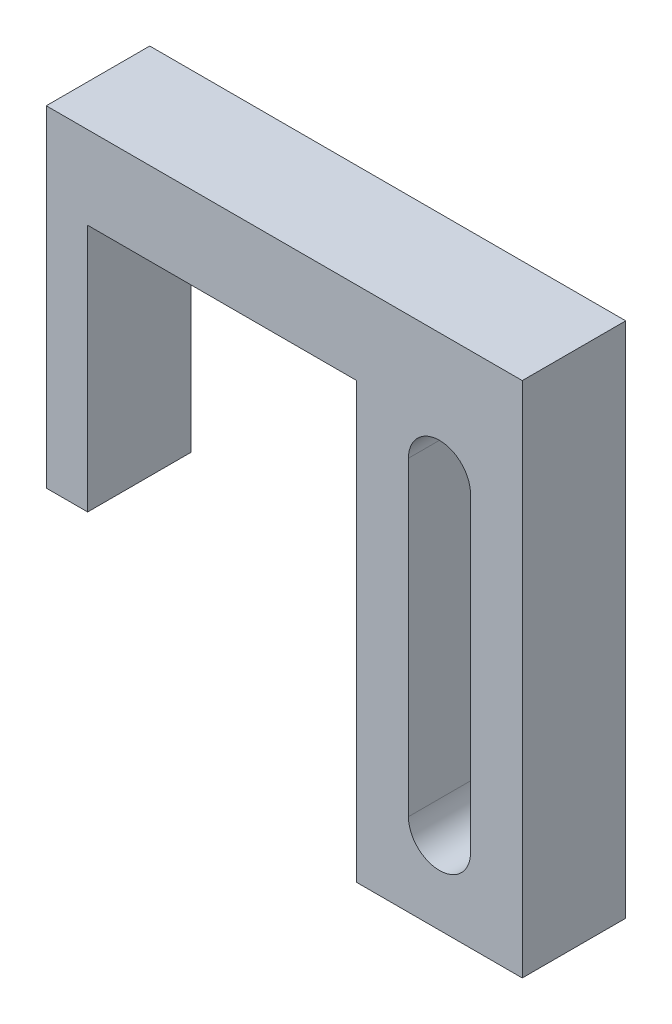
ISO-10303-21;
HEADER;
FILE_DESCRIPTION(('STEP AP214'),'2;1');
FILE_NAME('part.step','',(''),(''),'','','');
FILE_SCHEMA(('AUTOMOTIVE_DESIGN { 1 0 10303 214 1 1 1 1 }'));
ENDSEC;
DATA;
#1=APPLICATION_CONTEXT('core data for automotive mechanical design processes');
#2=APPLICATION_PROTOCOL_DEFINITION('international standard','automotive_design',2000,#1);
#3=PRODUCT_CONTEXT('',#1,'mechanical');
#4=PRODUCT('Part','Part','',(#3));
#5=PRODUCT_RELATED_PRODUCT_CATEGORY('part','',(#4));
#6=PRODUCT_DEFINITION_FORMATION('','',#4);
#7=PRODUCT_DEFINITION_CONTEXT('part definition',#1,'design');
#8=PRODUCT_DEFINITION('design','',#6,#7);
#9=PRODUCT_DEFINITION_SHAPE('','',#8);
#10=(LENGTH_UNIT() NAMED_UNIT(*) SI_UNIT(.MILLI.,.METRE.));
#11=(NAMED_UNIT(*) PLANE_ANGLE_UNIT() SI_UNIT($,.RADIAN.));
#12=(NAMED_UNIT(*) SI_UNIT($,.STERADIAN.) SOLID_ANGLE_UNIT());
#13=UNCERTAINTY_MEASURE_WITH_UNIT(LENGTH_MEASURE(1.E-05),#10,'distance_accuracy_value','');
#14=(GEOMETRIC_REPRESENTATION_CONTEXT(3) GLOBAL_UNCERTAINTY_ASSIGNED_CONTEXT((#13)) GLOBAL_UNIT_ASSIGNED_CONTEXT((#10,
#11,#12)) REPRESENTATION_CONTEXT('',''));
#15=CARTESIAN_POINT('',(0.,0.,0.));
#16=DIRECTION('',(0.,0.,1.));
#17=DIRECTION('',(1.,0.,0.));
#18=AXIS2_PLACEMENT_3D('',#15,#16,#17);
#19=CARTESIAN_POINT('',(-4.,8.5,-18.02417469626));
#20=DIRECTION('',(0.,-1.,0.));
#21=DIRECTION('',(1.,0.,0.));
#22=AXIS2_PLACEMENT_3D('',#19,#20,#21);
#23=PLANE('',#22);
#24=DIRECTION('',(1.,0.,0.));
#25=VECTOR('',#24,1.);
#26=CARTESIAN_POINT('',(-4.,8.5,2.5));
#27=LINE('',#26,#25);
#28=CARTESIAN_POINT('',(-17.,8.5,2.5));
#29=VERTEX_POINT('',#28);
#30=CARTESIAN_POINT('',(-4.,8.5,2.5));
#31=VERTEX_POINT('',#30);
#32=EDGE_CURVE('E189',#29,#31,#27,.T.);
#33=ORIENTED_EDGE('',*,*,#32,.F.);
#34=DIRECTION('',(0.,0.,1.));
#35=VECTOR('',#34,1.);
#36=CARTESIAN_POINT('',(-17.,8.5,2.5));
#37=LINE('',#36,#35);
#38=CARTESIAN_POINT('',(-17.,8.5,-2.5));
#39=VERTEX_POINT('',#38);
#40=EDGE_CURVE('E159',#39,#29,#37,.T.);
#41=ORIENTED_EDGE('',*,*,#40,.F.);
#42=DIRECTION('',(-1.,0.,0.));
#43=VECTOR('',#42,1.);
#44=CARTESIAN_POINT('',(-4.,8.5,-2.5));
#45=LINE('',#44,#43);
#46=CARTESIAN_POINT('',(-4.,8.49999999999999,-2.5));
#47=VERTEX_POINT('',#46);
#48=EDGE_CURVE('E183',#47,#39,#45,.T.);
#49=ORIENTED_EDGE('',*,*,#48,.F.);
#50=DIRECTION('',(0.,0.,1.));
#51=VECTOR('',#50,1.);
#52=CARTESIAN_POINT('',(-4.,8.5,-18.02417469626));
#53=LINE('',#52,#51);
#54=EDGE_CURVE('E184',#47,#31,#53,.T.);
#55=ORIENTED_EDGE('',*,*,#54,.T.);
#56=EDGE_LOOP('',(#33,#41,#49,#55));
#57=FACE_BOUND('',#56,.T.);
#58=ADVANCED_FACE('F37',(#57),#23,.T.);
#59=CARTESIAN_POINT('',(4.,-12.5,2.5));
#60=DIRECTION('',(-1.,0.,0.));
#61=DIRECTION('',(0.,0.,1.));
#62=AXIS2_PLACEMENT_3D('',#59,#60,#61);
#63=PLANE('',#62);
#64=DIRECTION('',(0.,1.,0.));
#65=VECTOR('',#64,1.);
#66=CARTESIAN_POINT('',(4.,-12.5,-2.5));
#67=LINE('',#66,#65);
#68=CARTESIAN_POINT('',(4.,-12.5,-2.5));
#69=VERTEX_POINT('',#68);
#70=CARTESIAN_POINT('',(4.,12.5,-2.5));
#71=VERTEX_POINT('',#70);
#72=EDGE_CURVE('E187',#69,#71,#67,.T.);
#73=ORIENTED_EDGE('',*,*,#72,.T.);
#74=DIRECTION('',(0.,0.,-1.));
#75=VECTOR('',#74,1.);
#76=CARTESIAN_POINT('',(4.,12.5,2.5));
#77=LINE('',#76,#75);
#78=CARTESIAN_POINT('',(4.,12.5,2.5));
#79=VERTEX_POINT('',#78);
#80=EDGE_CURVE('E11',#79,#71,#77,.T.);
#81=ORIENTED_EDGE('',*,*,#80,.F.);
#82=DIRECTION('',(0.,1.,0.));
#83=VECTOR('',#82,1.);
#84=CARTESIAN_POINT('',(4.,-12.5,2.5));
#85=LINE('',#84,#83);
#86=CARTESIAN_POINT('',(4.,-12.5,2.5));
#87=VERTEX_POINT('',#86);
#88=EDGE_CURVE('E196',#87,#79,#85,.T.);
#89=ORIENTED_EDGE('',*,*,#88,.F.);
#90=DIRECTION('',(0.,0.,-1.));
#91=VECTOR('',#90,1.);
#92=CARTESIAN_POINT('',(4.,-12.5,2.5));
#93=LINE('',#92,#91);
#94=EDGE_CURVE('E208',#87,#69,#93,.T.);
#95=ORIENTED_EDGE('',*,*,#94,.T.);
#96=EDGE_LOOP('',(#73,#81,#89,#95));
#97=FACE_BOUND('',#96,.T.);
#98=ADVANCED_FACE('F39',(#97),#63,.F.);
#99=CARTESIAN_POINT('',(4.,12.5,2.5));
#100=DIRECTION('',(0.,-1.,0.));
#101=DIRECTION('',(0.,0.,-1.));
#102=AXIS2_PLACEMENT_3D('',#99,#100,#101);
#103=PLANE('',#102);
#104=DIRECTION('',(-1.,0.,0.));
#105=VECTOR('',#104,1.);
#106=CARTESIAN_POINT('',(4.,12.5,-2.5));
#107=LINE('',#106,#105);
#108=CARTESIAN_POINT('',(-19.,12.5,-2.5));
#109=VERTEX_POINT('',#108);
#110=EDGE_CURVE('E211',#71,#109,#107,.T.);
#111=ORIENTED_EDGE('',*,*,#110,.T.);
#112=DIRECTION('',(0.,0.,1.));
#113=VECTOR('',#112,1.);
#114=CARTESIAN_POINT('',(-19.,12.5,-18.02417469626));
#115=LINE('',#114,#113);
#116=CARTESIAN_POINT('',(-19.,12.5,2.5));
#117=VERTEX_POINT('',#116);
#118=EDGE_CURVE('E191',#109,#117,#115,.T.);
#119=ORIENTED_EDGE('',*,*,#118,.T.);
#120=DIRECTION('',(-1.,0.,0.));
#121=VECTOR('',#120,1.);
#122=CARTESIAN_POINT('',(4.,12.5,2.5));
#123=LINE('',#122,#121);
#124=EDGE_CURVE('E199',#79,#117,#123,.T.);
#125=ORIENTED_EDGE('',*,*,#124,.F.);
#126=ORIENTED_EDGE('',*,*,#80,.T.);
#127=EDGE_LOOP('',(#111,#119,#125,#126));
#128=FACE_BOUND('',#127,.T.);
#129=ADVANCED_FACE('F251',(#128),#103,.F.);
#130=CARTESIAN_POINT('',(-4.,-12.5,2.5));
#131=DIRECTION('',(-1.,0.,0.));
#132=DIRECTION('',(0.,0.,1.));
#133=AXIS2_PLACEMENT_3D('',#130,#131,#132);
#134=PLANE('',#133);
#135=ORIENTED_EDGE('',*,*,#54,.F.);
#136=DIRECTION('',(0.,1.,0.));
#137=VECTOR('',#136,1.);
#138=CARTESIAN_POINT('',(-4.,-12.5,-2.5));
#139=LINE('',#138,#137);
#140=CARTESIAN_POINT('',(-4.,-12.5,-2.5));
#141=VERTEX_POINT('',#140);
#142=EDGE_CURVE('E213',#141,#47,#139,.T.);
#143=ORIENTED_EDGE('',*,*,#142,.F.);
#144=DIRECTION('',(0.,0.,-1.));
#145=VECTOR('',#144,1.);
#146=CARTESIAN_POINT('',(-4.,-12.5,2.5));
#147=LINE('',#146,#145);
#148=CARTESIAN_POINT('',(-4.,-12.5,2.5));
#149=VERTEX_POINT('',#148);
#150=EDGE_CURVE('E45',#149,#141,#147,.T.);
#151=ORIENTED_EDGE('',*,*,#150,.F.);
#152=DIRECTION('',(0.,1.,0.));
#153=VECTOR('',#152,1.);
#154=CARTESIAN_POINT('',(-4.,-12.5,2.5));
#155=LINE('',#154,#153);
#156=EDGE_CURVE('E202',#149,#31,#155,.T.);
#157=ORIENTED_EDGE('',*,*,#156,.T.);
#158=EDGE_LOOP('',(#135,#143,#151,#157));
#159=FACE_BOUND('',#158,.T.);
#160=ADVANCED_FACE('F225',(#159),#134,.T.);
#161=CARTESIAN_POINT('',(4.,-12.5,2.5));
#162=DIRECTION('',(0.,-1.,0.));
#163=DIRECTION('',(1.,0.,0.));
#164=AXIS2_PLACEMENT_3D('',#161,#162,#163);
#165=PLANE('',#164);
#166=DIRECTION('',(-1.,0.,0.));
#167=VECTOR('',#166,1.);
#168=CARTESIAN_POINT('',(4.,-12.5,-2.5));
#169=LINE('',#168,#167);
#170=EDGE_CURVE('E200',#69,#141,#169,.T.);
#171=ORIENTED_EDGE('',*,*,#170,.F.);
#172=ORIENTED_EDGE('',*,*,#94,.F.);
#173=DIRECTION('',(-1.,0.,0.));
#174=VECTOR('',#173,1.);
#175=CARTESIAN_POINT('',(4.,-12.5,2.5));
#176=LINE('',#175,#174);
#177=EDGE_CURVE('E205',#87,#149,#176,.T.);
#178=ORIENTED_EDGE('',*,*,#177,.T.);
#179=ORIENTED_EDGE('',*,*,#150,.T.);
#180=EDGE_LOOP('',(#171,#172,#178,#179));
#181=FACE_BOUND('',#180,.T.);
#182=ADVANCED_FACE('F221',(#181),#165,.T.);
#183=CARTESIAN_POINT('',(0.,0.,2.5));
#184=DIRECTION('',(0.,0.,1.));
#185=DIRECTION('',(1.,0.,0.));
#186=AXIS2_PLACEMENT_3D('',#183,#184,#185);
#187=PLANE('',#186);
#188=CARTESIAN_POINT('',(0.,6.5,2.5));
#189=DIRECTION('',(0.,0.,1.));
#190=DIRECTION('',(1.,0.,0.));
#191=AXIS2_PLACEMENT_3D('',#188,#189,#190);
#192=CIRCLE('',#191,1.5);
#193=CARTESIAN_POINT('',(1.5,6.5,2.5));
#194=VERTEX_POINT('',#193);
#195=CARTESIAN_POINT('',(-1.5,6.5,2.5));
#196=VERTEX_POINT('',#195);
#197=EDGE_CURVE('E52',#194,#196,#192,.T.);
#198=ORIENTED_EDGE('',*,*,#197,.F.);
#199=DIRECTION('',(0.,1.,0.));
#200=VECTOR('',#199,1.);
#201=CARTESIAN_POINT('',(1.5,6.5,2.5));
#202=LINE('',#201,#200);
#203=CARTESIAN_POINT('',(1.5,-8.5,2.5));
#204=VERTEX_POINT('',#203);
#205=EDGE_CURVE('E144',#204,#194,#202,.T.);
#206=ORIENTED_EDGE('',*,*,#205,.F.);
#207=CARTESIAN_POINT('',(0.,-8.5,2.5));
#208=DIRECTION('',(0.,0.,1.));
#209=DIRECTION('',(1.,0.,0.));
#210=AXIS2_PLACEMENT_3D('',#207,#208,#209);
#211=CIRCLE('',#210,1.5);
#212=CARTESIAN_POINT('',(-1.5,-8.5,2.5));
#213=VERTEX_POINT('',#212);
#214=EDGE_CURVE('E147',#213,#204,#211,.T.);
#215=ORIENTED_EDGE('',*,*,#214,.F.);
#216=DIRECTION('',(0.,-1.,0.));
#217=VECTOR('',#216,1.);
#218=CARTESIAN_POINT('',(-1.5,6.5,2.5));
#219=LINE('',#218,#217);
#220=EDGE_CURVE('E153',#196,#213,#219,.T.);
#221=ORIENTED_EDGE('',*,*,#220,.F.);
#222=EDGE_LOOP('',(#198,#206,#215,#221));
#223=FACE_BOUND('',#222,.T.);
#224=ORIENTED_EDGE('',*,*,#88,.T.);
#225=ORIENTED_EDGE('',*,*,#124,.T.);
#226=DIRECTION('',(0.,-1.,0.));
#227=VECTOR('',#226,1.);
#228=CARTESIAN_POINT('',(-19.,12.5,2.5));
#229=LINE('',#228,#227);
#230=CARTESIAN_POINT('',(-19.,-3.5,2.5));
#231=VERTEX_POINT('',#230);
#232=EDGE_CURVE('E179',#117,#231,#229,.T.);
#233=ORIENTED_EDGE('',*,*,#232,.T.);
#234=DIRECTION('',(-1.,0.,0.));
#235=VECTOR('',#234,1.);
#236=CARTESIAN_POINT('',(-19.,-3.5,2.5));
#237=LINE('',#236,#235);
#238=CARTESIAN_POINT('',(-17.,-3.5,2.5));
#239=VERTEX_POINT('',#238);
#240=EDGE_CURVE('E163',#239,#231,#237,.T.);
#241=ORIENTED_EDGE('',*,*,#240,.F.);
#242=DIRECTION('',(0.,1.,0.));
#243=VECTOR('',#242,1.);
#244=CARTESIAN_POINT('',(-17.,-3.5,2.5));
#245=LINE('',#244,#243);
#246=EDGE_CURVE('E173',#239,#29,#245,.T.);
#247=ORIENTED_EDGE('',*,*,#246,.T.);
#248=ORIENTED_EDGE('',*,*,#32,.T.);
#249=ORIENTED_EDGE('',*,*,#156,.F.);
#250=ORIENTED_EDGE('',*,*,#177,.F.);
#251=EDGE_LOOP('',(#224,#225,#233,#241,#247,#248,#249,#250));
#252=FACE_BOUND('',#251,.T.);
#253=ADVANCED_FACE('F232',(#223,#252),#187,.T.);
#254=CARTESIAN_POINT('',(0.,0.,-2.5));
#255=DIRECTION('',(0.,0.,1.));
#256=DIRECTION('',(1.,0.,0.));
#257=AXIS2_PLACEMENT_3D('',#254,#255,#256);
#258=PLANE('',#257);
#259=DIRECTION('',(0.,1.,0.));
#260=VECTOR('',#259,1.);
#261=CARTESIAN_POINT('',(1.5,6.5,-2.5));
#262=LINE('',#261,#260);
#263=CARTESIAN_POINT('',(1.5,-8.5,-2.5));
#264=VERTEX_POINT('',#263);
#265=CARTESIAN_POINT('',(1.5,6.5,-2.5));
#266=VERTEX_POINT('',#265);
#267=EDGE_CURVE('E134',#264,#266,#262,.T.);
#268=ORIENTED_EDGE('',*,*,#267,.T.);
#269=CARTESIAN_POINT('',(0.,6.5,-2.5));
#270=DIRECTION('',(0.,0.,1.));
#271=DIRECTION('',(1.,0.,0.));
#272=AXIS2_PLACEMENT_3D('',#269,#270,#271);
#273=CIRCLE('',#272,1.5);
#274=CARTESIAN_POINT('',(-1.5,6.5,-2.5));
#275=VERTEX_POINT('',#274);
#276=EDGE_CURVE('E128',#266,#275,#273,.T.);
#277=ORIENTED_EDGE('',*,*,#276,.T.);
#278=DIRECTION('',(0.,-1.,0.));
#279=VECTOR('',#278,1.);
#280=CARTESIAN_POINT('',(-1.5,6.5,-2.5));
#281=LINE('',#280,#279);
#282=CARTESIAN_POINT('',(-1.5,-8.5,-2.5));
#283=VERTEX_POINT('',#282);
#284=EDGE_CURVE('E137',#275,#283,#281,.T.);
#285=ORIENTED_EDGE('',*,*,#284,.T.);
#286=CARTESIAN_POINT('',(0.,-8.5,-2.5));
#287=DIRECTION('',(0.,0.,1.));
#288=DIRECTION('',(1.,0.,0.));
#289=AXIS2_PLACEMENT_3D('',#286,#287,#288);
#290=CIRCLE('',#289,1.5);
#291=EDGE_CURVE('E60',#283,#264,#290,.T.);
#292=ORIENTED_EDGE('',*,*,#291,.T.);
#293=EDGE_LOOP('',(#268,#277,#285,#292));
#294=FACE_BOUND('',#293,.T.);
#295=ORIENTED_EDGE('',*,*,#72,.F.);
#296=ORIENTED_EDGE('',*,*,#170,.T.);
#297=ORIENTED_EDGE('',*,*,#142,.T.);
#298=ORIENTED_EDGE('',*,*,#48,.T.);
#299=DIRECTION('',(0.,1.,0.));
#300=VECTOR('',#299,1.);
#301=CARTESIAN_POINT('',(-17.,-3.5,-2.5));
#302=LINE('',#301,#300);
#303=CARTESIAN_POINT('',(-17.,-3.5,-2.5));
#304=VERTEX_POINT('',#303);
#305=EDGE_CURVE('E177',#304,#39,#302,.T.);
#306=ORIENTED_EDGE('',*,*,#305,.F.);
#307=DIRECTION('',(1.,0.,0.));
#308=VECTOR('',#307,1.);
#309=CARTESIAN_POINT('',(-19.,-3.5,-2.5));
#310=LINE('',#309,#308);
#311=CARTESIAN_POINT('',(-19.,-3.5,-2.5));
#312=VERTEX_POINT('',#311);
#313=EDGE_CURVE('E169',#312,#304,#310,.T.);
#314=ORIENTED_EDGE('',*,*,#313,.F.);
#315=DIRECTION('',(0.,1.,0.));
#316=VECTOR('',#315,1.);
#317=CARTESIAN_POINT('',(-19.,12.5,-2.5));
#318=LINE('',#317,#316);
#319=EDGE_CURVE('E180',#312,#109,#318,.T.);
#320=ORIENTED_EDGE('',*,*,#319,.T.);
#321=ORIENTED_EDGE('',*,*,#110,.F.);
#322=EDGE_LOOP('',(#295,#296,#297,#298,#306,#314,#320,#321));
#323=FACE_BOUND('',#322,.T.);
#324=ADVANCED_FACE('F141',(#294,#323),#258,.F.);
#325=CARTESIAN_POINT('',(-19.,12.5,-18.02417469626));
#326=DIRECTION('',(-1.,0.,0.));
#327=DIRECTION('',(0.,-1.,0.));
#328=AXIS2_PLACEMENT_3D('',#325,#326,#327);
#329=PLANE('',#328);
#330=ORIENTED_EDGE('',*,*,#319,.F.);
#331=DIRECTION('',(0.,0.,-1.));
#332=VECTOR('',#331,1.);
#333=CARTESIAN_POINT('',(-19.,-3.5,2.5));
#334=LINE('',#333,#332);
#335=EDGE_CURVE('E166',#231,#312,#334,.T.);
#336=ORIENTED_EDGE('',*,*,#335,.F.);
#337=ORIENTED_EDGE('',*,*,#232,.F.);
#338=ORIENTED_EDGE('',*,*,#118,.F.);
#339=EDGE_LOOP('',(#330,#336,#337,#338));
#340=FACE_BOUND('',#339,.T.);
#341=ADVANCED_FACE('F248',(#340),#329,.T.);
#342=CARTESIAN_POINT('',(-17.,-3.5,2.5));
#343=DIRECTION('',(-1.,0.,0.));
#344=DIRECTION('',(0.,-1.,0.));
#345=AXIS2_PLACEMENT_3D('',#342,#343,#344);
#346=PLANE('',#345);
#347=ORIENTED_EDGE('',*,*,#40,.T.);
#348=ORIENTED_EDGE('',*,*,#246,.F.);
#349=DIRECTION('',(0.,0.,1.));
#350=VECTOR('',#349,1.);
#351=CARTESIAN_POINT('',(-17.,-3.5,2.5));
#352=LINE('',#351,#350);
#353=EDGE_CURVE('E171',#304,#239,#352,.T.);
#354=ORIENTED_EDGE('',*,*,#353,.F.);
#355=ORIENTED_EDGE('',*,*,#305,.T.);
#356=EDGE_LOOP('',(#347,#348,#354,#355));
#357=FACE_BOUND('',#356,.T.);
#358=ADVANCED_FACE('F241',(#357),#346,.F.);
#359=CARTESIAN_POINT('',(0.,-3.5,0.));
#360=DIRECTION('',(0.,1.,0.));
#361=DIRECTION('',(0.,0.,1.));
#362=AXIS2_PLACEMENT_3D('',#359,#360,#361);
#363=PLANE('',#362);
#364=ORIENTED_EDGE('',*,*,#240,.T.);
#365=ORIENTED_EDGE('',*,*,#335,.T.);
#366=ORIENTED_EDGE('',*,*,#313,.T.);
#367=ORIENTED_EDGE('',*,*,#353,.T.);
#368=EDGE_LOOP('',(#364,#365,#366,#367));
#369=FACE_BOUND('',#368,.T.);
#370=ADVANCED_FACE('F244',(#369),#363,.F.);
#371=CARTESIAN_POINT('',(0.,6.5,-2.5));
#372=DIRECTION('',(0.,0.,1.));
#373=DIRECTION('',(1.,0.,0.));
#374=AXIS2_PLACEMENT_3D('',#371,#372,#373);
#375=CYLINDRICAL_SURFACE('',#374,1.5);
#376=ORIENTED_EDGE('',*,*,#197,.T.);
#377=DIRECTION('',(0.,0.,1.));
#378=VECTOR('',#377,1.);
#379=CARTESIAN_POINT('',(-1.5,6.5,-2.5));
#380=LINE('',#379,#378);
#381=EDGE_CURVE('E124',#275,#196,#380,.T.);
#382=ORIENTED_EDGE('',*,*,#381,.F.);
#383=ORIENTED_EDGE('',*,*,#276,.F.);
#384=DIRECTION('',(0.,0.,1.));
#385=VECTOR('',#384,1.);
#386=CARTESIAN_POINT('',(1.5,6.5,-2.5));
#387=LINE('',#386,#385);
#388=EDGE_CURVE('E157',#266,#194,#387,.T.);
#389=ORIENTED_EDGE('',*,*,#388,.T.);
#390=EDGE_LOOP('',(#376,#382,#383,#389));
#391=FACE_BOUND('',#390,.T.);
#392=ADVANCED_FACE('F126',(#391),#375,.F.);
#393=CARTESIAN_POINT('',(1.5,6.5,-2.5));
#394=DIRECTION('',(1.,0.,0.));
#395=DIRECTION('',(0.,1.,0.));
#396=AXIS2_PLACEMENT_3D('',#393,#394,#395);
#397=PLANE('',#396);
#398=ORIENTED_EDGE('',*,*,#205,.T.);
#399=ORIENTED_EDGE('',*,*,#388,.F.);
#400=ORIENTED_EDGE('',*,*,#267,.F.);
#401=DIRECTION('',(0.,0.,1.));
#402=VECTOR('',#401,1.);
#403=CARTESIAN_POINT('',(1.5,-8.5,-2.5));
#404=LINE('',#403,#402);
#405=EDGE_CURVE('E160',#264,#204,#404,.T.);
#406=ORIENTED_EDGE('',*,*,#405,.T.);
#407=EDGE_LOOP('',(#398,#399,#400,#406));
#408=FACE_BOUND('',#407,.T.);
#409=ADVANCED_FACE('F306',(#408),#397,.F.);
#410=CARTESIAN_POINT('',(0.,-8.5,-2.5));
#411=DIRECTION('',(0.,0.,1.));
#412=DIRECTION('',(1.,0.,0.));
#413=AXIS2_PLACEMENT_3D('',#410,#411,#412);
#414=CYLINDRICAL_SURFACE('',#413,1.5);
#415=ORIENTED_EDGE('',*,*,#214,.T.);
#416=ORIENTED_EDGE('',*,*,#405,.F.);
#417=ORIENTED_EDGE('',*,*,#291,.F.);
#418=DIRECTION('',(0.,0.,1.));
#419=VECTOR('',#418,1.);
#420=CARTESIAN_POINT('',(-1.5,-8.5,-2.5));
#421=LINE('',#420,#419);
#422=EDGE_CURVE('E133',#283,#213,#421,.T.);
#423=ORIENTED_EDGE('',*,*,#422,.T.);
#424=EDGE_LOOP('',(#415,#416,#417,#423));
#425=FACE_BOUND('',#424,.T.);
#426=ADVANCED_FACE('F313',(#425),#414,.F.);
#427=CARTESIAN_POINT('',(-1.5,6.5,-2.5));
#428=DIRECTION('',(-1.,0.,0.));
#429=DIRECTION('',(0.,-1.,0.));
#430=AXIS2_PLACEMENT_3D('',#427,#428,#429);
#431=PLANE('',#430);
#432=ORIENTED_EDGE('',*,*,#220,.T.);
#433=ORIENTED_EDGE('',*,*,#422,.F.);
#434=ORIENTED_EDGE('',*,*,#284,.F.);
#435=ORIENTED_EDGE('',*,*,#381,.T.);
#436=EDGE_LOOP('',(#432,#433,#434,#435));
#437=FACE_BOUND('',#436,.T.);
#438=ADVANCED_FACE('F138',(#437),#431,.F.);
#439=CLOSED_SHELL('',(#58,#98,#129,#160,#182,#253,#324,#341,#358,#370,#392,#409,#426,#438));
#440=MANIFOLD_SOLID_BREP('B2',#439);
#441=ADVANCED_BREP_SHAPE_REPRESENTATION('',(#18,#440),#14);
#442=SHAPE_DEFINITION_REPRESENTATION(#9,#441);
ENDSEC;
END-ISO-10303-21;
